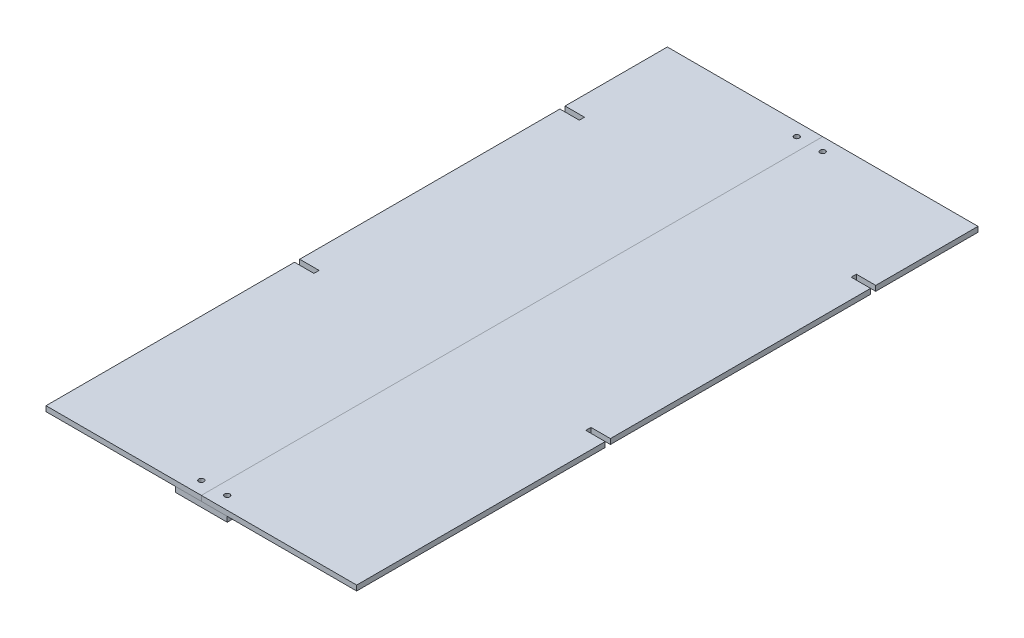
ISO-10303-21;
HEADER;
FILE_DESCRIPTION(('STEP AP214'),'2;1');
FILE_NAME('part.step','',(''),(''),'','','');
FILE_SCHEMA(('AUTOMOTIVE_DESIGN { 1 0 10303 214 1 1 1 1 }'));
ENDSEC;
DATA;
#1=APPLICATION_CONTEXT('core data for automotive mechanical design processes');
#2=APPLICATION_PROTOCOL_DEFINITION('international standard','automotive_design',2000,#1);
#3=PRODUCT_CONTEXT('',#1,'mechanical');
#4=PRODUCT('Part','Part','',(#3));
#5=PRODUCT_RELATED_PRODUCT_CATEGORY('part','',(#4));
#6=PRODUCT_DEFINITION_FORMATION('','',#4);
#7=PRODUCT_DEFINITION_CONTEXT('part definition',#1,'design');
#8=PRODUCT_DEFINITION('design','',#6,#7);
#9=PRODUCT_DEFINITION_SHAPE('','',#8);
#10=(LENGTH_UNIT() NAMED_UNIT(*) SI_UNIT(.MILLI.,.METRE.));
#11=(NAMED_UNIT(*) PLANE_ANGLE_UNIT() SI_UNIT($,.RADIAN.));
#12=(NAMED_UNIT(*) SI_UNIT($,.STERADIAN.) SOLID_ANGLE_UNIT());
#13=UNCERTAINTY_MEASURE_WITH_UNIT(LENGTH_MEASURE(1.E-05),#10,'distance_accuracy_value','');
#14=(GEOMETRIC_REPRESENTATION_CONTEXT(3) GLOBAL_UNCERTAINTY_ASSIGNED_CONTEXT((#13)) GLOBAL_UNIT_ASSIGNED_CONTEXT((#10,
#11,#12)) REPRESENTATION_CONTEXT('',''));
#15=CARTESIAN_POINT('',(0.,0.,0.));
#16=DIRECTION('',(0.,0.,1.));
#17=DIRECTION('',(1.,0.,0.));
#18=AXIS2_PLACEMENT_3D('',#15,#16,#17);
#19=CARTESIAN_POINT('',(-25.4,-5.08,304.8));
#20=DIRECTION('',(1.,0.,0.));
#21=DIRECTION('',(0.,0.,-1.));
#22=AXIS2_PLACEMENT_3D('',#19,#20,#21);
#23=PLANE('',#22);
#24=DIRECTION('',(0.,0.,-1.));
#25=VECTOR('',#24,1.);
#26=CARTESIAN_POINT('',(-25.4,0.,304.8));
#27=LINE('',#26,#25);
#28=CARTESIAN_POINT('',(-25.4,0.,304.8));
#29=VERTEX_POINT('',#28);
#30=CARTESIAN_POINT('',(-25.4,0.,-304.8));
#31=VERTEX_POINT('',#30);
#32=EDGE_CURVE('E134',#29,#31,#27,.T.);
#33=ORIENTED_EDGE('',*,*,#32,.T.);
#34=DIRECTION('',(0.,1.,0.));
#35=VECTOR('',#34,1.);
#36=CARTESIAN_POINT('',(-25.4,-5.08,-304.8));
#37=LINE('',#36,#35);
#38=CARTESIAN_POINT('',(-25.4,-5.08,-304.8));
#39=VERTEX_POINT('',#38);
#40=EDGE_CURVE('E13',#39,#31,#37,.T.);
#41=ORIENTED_EDGE('',*,*,#40,.F.);
#42=DIRECTION('',(0.,0.,-1.));
#43=VECTOR('',#42,1.);
#44=CARTESIAN_POINT('',(-25.4,-5.08,304.8));
#45=LINE('',#44,#43);
#46=CARTESIAN_POINT('',(-25.4,-5.08,304.8));
#47=VERTEX_POINT('',#46);
#48=EDGE_CURVE('E105',#47,#39,#45,.T.);
#49=ORIENTED_EDGE('',*,*,#48,.F.);
#50=DIRECTION('',(0.,1.,0.));
#51=VECTOR('',#50,1.);
#52=CARTESIAN_POINT('',(-25.4,-5.08,304.8));
#53=LINE('',#52,#51);
#54=EDGE_CURVE('E116',#47,#29,#53,.T.);
#55=ORIENTED_EDGE('',*,*,#54,.T.);
#56=EDGE_LOOP('',(#33,#41,#49,#55));
#57=FACE_BOUND('',#56,.T.);
#58=ADVANCED_FACE('F54',(#57),#23,.F.);
#59=CARTESIAN_POINT('',(25.4,-5.08,-304.8));
#60=DIRECTION('',(0.,0.,1.));
#61=DIRECTION('',(1.,0.,0.));
#62=AXIS2_PLACEMENT_3D('',#59,#60,#61);
#63=PLANE('',#62);
#64=DIRECTION('',(1.,0.,0.));
#65=VECTOR('',#64,1.);
#66=CARTESIAN_POINT('',(25.4,0.,-304.8));
#67=LINE('',#66,#65);
#68=CARTESIAN_POINT('',(25.4,0.,-304.8));
#69=VERTEX_POINT('',#68);
#70=EDGE_CURVE('E110',#31,#69,#67,.T.);
#71=ORIENTED_EDGE('',*,*,#70,.T.);
#72=DIRECTION('',(0.,1.,0.));
#73=VECTOR('',#72,1.);
#74=CARTESIAN_POINT('',(25.4,-5.08,-304.8));
#75=LINE('',#74,#73);
#76=CARTESIAN_POINT('',(25.4,-5.08,-304.8));
#77=VERTEX_POINT('',#76);
#78=EDGE_CURVE('E62',#77,#69,#75,.T.);
#79=ORIENTED_EDGE('',*,*,#78,.F.);
#80=DIRECTION('',(1.,0.,0.));
#81=VECTOR('',#80,1.);
#82=CARTESIAN_POINT('',(25.4,-5.08,-304.8));
#83=LINE('',#82,#81);
#84=EDGE_CURVE('E100',#39,#77,#83,.T.);
#85=ORIENTED_EDGE('',*,*,#84,.F.);
#86=ORIENTED_EDGE('',*,*,#40,.T.);
#87=EDGE_LOOP('',(#71,#79,#85,#86));
#88=FACE_BOUND('',#87,.T.);
#89=ADVANCED_FACE('F109',(#88),#63,.F.);
#90=CARTESIAN_POINT('',(25.4,-5.08,304.8));
#91=DIRECTION('',(-1.,0.,0.));
#92=DIRECTION('',(0.,0.,1.));
#93=AXIS2_PLACEMENT_3D('',#90,#91,#92);
#94=PLANE('',#93);
#95=DIRECTION('',(0.,0.,1.));
#96=VECTOR('',#95,1.);
#97=CARTESIAN_POINT('',(25.4,0.,304.8));
#98=LINE('',#97,#96);
#99=CARTESIAN_POINT('',(25.4,0.,304.8));
#100=VERTEX_POINT('',#99);
#101=EDGE_CURVE('E87',#69,#100,#98,.T.);
#102=ORIENTED_EDGE('',*,*,#101,.T.);
#103=DIRECTION('',(0.,1.,0.));
#104=VECTOR('',#103,1.);
#105=CARTESIAN_POINT('',(25.4,-5.08,304.8));
#106=LINE('',#105,#104);
#107=CARTESIAN_POINT('',(25.4,-5.08,304.8));
#108=VERTEX_POINT('',#107);
#109=EDGE_CURVE('E111',#108,#100,#106,.T.);
#110=ORIENTED_EDGE('',*,*,#109,.F.);
#111=DIRECTION('',(0.,0.,1.));
#112=VECTOR('',#111,1.);
#113=CARTESIAN_POINT('',(25.4,-5.08,304.8));
#114=LINE('',#113,#112);
#115=EDGE_CURVE('E103',#77,#108,#114,.T.);
#116=ORIENTED_EDGE('',*,*,#115,.F.);
#117=ORIENTED_EDGE('',*,*,#78,.T.);
#118=EDGE_LOOP('',(#102,#110,#116,#117));
#119=FACE_BOUND('',#118,.T.);
#120=ADVANCED_FACE('F112',(#119),#94,.F.);
#121=CARTESIAN_POINT('',(25.4,-5.08,304.8));
#122=DIRECTION('',(0.,0.,-1.));
#123=DIRECTION('',(-1.,0.,0.));
#124=AXIS2_PLACEMENT_3D('',#121,#122,#123);
#125=PLANE('',#124);
#126=DIRECTION('',(-1.,0.,0.));
#127=VECTOR('',#126,1.);
#128=CARTESIAN_POINT('',(25.4,0.,304.8));
#129=LINE('',#128,#127);
#130=EDGE_CURVE('E93',#100,#29,#129,.T.);
#131=ORIENTED_EDGE('',*,*,#130,.T.);
#132=ORIENTED_EDGE('',*,*,#54,.F.);
#133=DIRECTION('',(-1.,0.,0.));
#134=VECTOR('',#133,1.);
#135=CARTESIAN_POINT('',(25.4,-5.08,304.8));
#136=LINE('',#135,#134);
#137=EDGE_CURVE('E70',#108,#47,#136,.T.);
#138=ORIENTED_EDGE('',*,*,#137,.F.);
#139=ORIENTED_EDGE('',*,*,#109,.T.);
#140=EDGE_LOOP('',(#131,#132,#138,#139));
#141=FACE_BOUND('',#140,.T.);
#142=ADVANCED_FACE('F186',(#141),#125,.F.);
#143=CARTESIAN_POINT('',(0.,-5.08,0.));
#144=DIRECTION('',(0.,1.,0.));
#145=DIRECTION('',(0.,0.,1.));
#146=AXIS2_PLACEMENT_3D('',#143,#144,#145);
#147=PLANE('',#146);
#148=CARTESIAN_POINT('',(-12.7,-5.08,292.1));
#149=DIRECTION('',(0.,1.,0.));
#150=DIRECTION('',(0.,0.,1.));
#151=AXIS2_PLACEMENT_3D('',#148,#149,#150);
#152=CIRCLE('',#151,2.0193);
#153=CARTESIAN_POINT('',(-12.7,-5.08,294.1193));
#154=VERTEX_POINT('',#153);
#155=EDGE_CURVE('E155',#154,#154,#152,.T.);
#156=ORIENTED_EDGE('',*,*,#155,.T.);
#157=EDGE_LOOP('',(#156));
#158=FACE_BOUND('',#157,.T.);
#159=CARTESIAN_POINT('',(12.7,-5.08,292.1));
#160=DIRECTION('',(0.,1.,0.));
#161=DIRECTION('',(0.,0.,1.));
#162=AXIS2_PLACEMENT_3D('',#159,#160,#161);
#163=CIRCLE('',#162,2.0193);
#164=CARTESIAN_POINT('',(12.7,-5.08,294.1193));
#165=VERTEX_POINT('',#164);
#166=EDGE_CURVE('E148',#165,#165,#163,.T.);
#167=ORIENTED_EDGE('',*,*,#166,.T.);
#168=EDGE_LOOP('',(#167));
#169=FACE_BOUND('',#168,.T.);
#170=CARTESIAN_POINT('',(-12.7,-5.08,-292.1));
#171=DIRECTION('',(0.,1.,0.));
#172=DIRECTION('',(0.,0.,1.));
#173=AXIS2_PLACEMENT_3D('',#170,#171,#172);
#174=CIRCLE('',#173,2.0193);
#175=CARTESIAN_POINT('',(-12.7,-5.08,-290.0807));
#176=VERTEX_POINT('',#175);
#177=EDGE_CURVE('E138',#176,#176,#174,.T.);
#178=ORIENTED_EDGE('',*,*,#177,.T.);
#179=EDGE_LOOP('',(#178));
#180=FACE_BOUND('',#179,.T.);
#181=CARTESIAN_POINT('',(12.7,-5.08,-292.1));
#182=DIRECTION('',(0.,1.,0.));
#183=DIRECTION('',(0.,0.,1.));
#184=AXIS2_PLACEMENT_3D('',#181,#182,#183);
#185=CIRCLE('',#184,2.0193);
#186=CARTESIAN_POINT('',(12.7,-5.08,-290.0807));
#187=VERTEX_POINT('',#186);
#188=EDGE_CURVE('E129',#187,#187,#185,.T.);
#189=ORIENTED_EDGE('',*,*,#188,.T.);
#190=EDGE_LOOP('',(#189));
#191=FACE_BOUND('',#190,.T.);
#192=ORIENTED_EDGE('',*,*,#48,.T.);
#193=ORIENTED_EDGE('',*,*,#84,.T.);
#194=ORIENTED_EDGE('',*,*,#115,.T.);
#195=ORIENTED_EDGE('',*,*,#137,.T.);
#196=EDGE_LOOP('',(#192,#193,#194,#195));
#197=FACE_BOUND('',#196,.T.);
#198=ADVANCED_FACE('F101',(#158,#169,#180,#191,#197),#147,.F.);
#199=CARTESIAN_POINT('',(0.,0.,0.));
#200=DIRECTION('',(0.,1.,0.));
#201=DIRECTION('',(0.,0.,1.));
#202=AXIS2_PLACEMENT_3D('',#199,#200,#201);
#203=PLANE('',#202);
#204=CARTESIAN_POINT('',(-12.7,0.,292.1));
#205=DIRECTION('',(0.,1.,0.));
#206=DIRECTION('',(0.,0.,1.));
#207=AXIS2_PLACEMENT_3D('',#204,#205,#206);
#208=CIRCLE('',#207,2.0193);
#209=CARTESIAN_POINT('',(-12.7,0.,294.1193));
#210=VERTEX_POINT('',#209);
#211=EDGE_CURVE('E160',#210,#210,#208,.T.);
#212=ORIENTED_EDGE('',*,*,#211,.F.);
#213=EDGE_LOOP('',(#212));
#214=FACE_BOUND('',#213,.T.);
#215=CARTESIAN_POINT('',(12.7,0.,292.1));
#216=DIRECTION('',(0.,1.,0.));
#217=DIRECTION('',(0.,0.,1.));
#218=AXIS2_PLACEMENT_3D('',#215,#216,#217);
#219=CIRCLE('',#218,2.0193);
#220=CARTESIAN_POINT('',(12.7,0.,294.1193));
#221=VERTEX_POINT('',#220);
#222=EDGE_CURVE('E153',#221,#221,#219,.T.);
#223=ORIENTED_EDGE('',*,*,#222,.F.);
#224=EDGE_LOOP('',(#223));
#225=FACE_BOUND('',#224,.T.);
#226=CARTESIAN_POINT('',(-12.7,0.,-292.1));
#227=DIRECTION('',(0.,1.,0.));
#228=DIRECTION('',(0.,0.,1.));
#229=AXIS2_PLACEMENT_3D('',#226,#227,#228);
#230=CIRCLE('',#229,2.0193);
#231=CARTESIAN_POINT('',(-12.7,0.,-290.0807));
#232=VERTEX_POINT('',#231);
#233=EDGE_CURVE('E143',#232,#232,#230,.T.);
#234=ORIENTED_EDGE('',*,*,#233,.F.);
#235=EDGE_LOOP('',(#234));
#236=FACE_BOUND('',#235,.T.);
#237=CARTESIAN_POINT('',(12.7,0.,-292.1));
#238=DIRECTION('',(0.,1.,0.));
#239=DIRECTION('',(0.,0.,1.));
#240=AXIS2_PLACEMENT_3D('',#237,#238,#239);
#241=CIRCLE('',#240,2.0193);
#242=CARTESIAN_POINT('',(12.7,0.,-290.0807));
#243=VERTEX_POINT('',#242);
#244=EDGE_CURVE('E135',#243,#243,#241,.T.);
#245=ORIENTED_EDGE('',*,*,#244,.F.);
#246=EDGE_LOOP('',(#245));
#247=FACE_BOUND('',#246,.T.);
#248=ORIENTED_EDGE('',*,*,#32,.F.);
#249=ORIENTED_EDGE('',*,*,#130,.F.);
#250=ORIENTED_EDGE('',*,*,#101,.F.);
#251=ORIENTED_EDGE('',*,*,#70,.F.);
#252=EDGE_LOOP('',(#248,#249,#250,#251));
#253=FACE_BOUND('',#252,.T.);
#254=ADVANCED_FACE('F166',(#214,#225,#236,#247,#253),#203,.T.);
#255=CARTESIAN_POINT('',(12.7,0.,-292.1));
#256=DIRECTION('',(0.,1.,0.));
#257=DIRECTION('',(0.,0.,1.));
#258=AXIS2_PLACEMENT_3D('',#255,#256,#257);
#259=CYLINDRICAL_SURFACE('',#258,2.0193);
#260=ORIENTED_EDGE('',*,*,#188,.F.);
#261=EDGE_LOOP('',(#260));
#262=FACE_BOUND('',#261,.T.);
#263=ORIENTED_EDGE('',*,*,#244,.T.);
#264=EDGE_LOOP('',(#263));
#265=FACE_BOUND('',#264,.T.);
#266=ADVANCED_FACE('F169',(#262,#265),#259,.F.);
#267=CARTESIAN_POINT('',(-12.7,0.,-292.1));
#268=DIRECTION('',(0.,1.,0.));
#269=DIRECTION('',(0.,0.,1.));
#270=AXIS2_PLACEMENT_3D('',#267,#268,#269);
#271=CYLINDRICAL_SURFACE('',#270,2.0193);
#272=ORIENTED_EDGE('',*,*,#177,.F.);
#273=EDGE_LOOP('',(#272));
#274=FACE_BOUND('',#273,.T.);
#275=ORIENTED_EDGE('',*,*,#233,.T.);
#276=EDGE_LOOP('',(#275));
#277=FACE_BOUND('',#276,.T.);
#278=ADVANCED_FACE('F203',(#274,#277),#271,.F.);
#279=CARTESIAN_POINT('',(12.7,0.,292.1));
#280=DIRECTION('',(0.,1.,0.));
#281=DIRECTION('',(0.,0.,1.));
#282=AXIS2_PLACEMENT_3D('',#279,#280,#281);
#283=CYLINDRICAL_SURFACE('',#282,2.0193);
#284=ORIENTED_EDGE('',*,*,#166,.F.);
#285=EDGE_LOOP('',(#284));
#286=FACE_BOUND('',#285,.T.);
#287=ORIENTED_EDGE('',*,*,#222,.T.);
#288=EDGE_LOOP('',(#287));
#289=FACE_BOUND('',#288,.T.);
#290=ADVANCED_FACE('F207',(#286,#289),#283,.F.);
#291=CARTESIAN_POINT('',(-12.7,0.,292.1));
#292=DIRECTION('',(0.,1.,0.));
#293=DIRECTION('',(0.,0.,1.));
#294=AXIS2_PLACEMENT_3D('',#291,#292,#293);
#295=CYLINDRICAL_SURFACE('',#294,2.0193);
#296=ORIENTED_EDGE('',*,*,#155,.F.);
#297=EDGE_LOOP('',(#296));
#298=FACE_BOUND('',#297,.T.);
#299=ORIENTED_EDGE('',*,*,#211,.T.);
#300=EDGE_LOOP('',(#299));
#301=FACE_BOUND('',#300,.T.);
#302=ADVANCED_FACE('F164',(#298,#301),#295,.F.);
#303=CLOSED_SHELL('',(#58,#89,#120,#142,#198,#254,#266,#278,#290,#302));
#304=MANIFOLD_SOLID_BREP('B2',#303);
#305=CARTESIAN_POINT('',(0.,0.,0.));
#306=DIRECTION('',(1.,0.,0.));
#307=DIRECTION('',(0.,0.,-1.));
#308=AXIS2_PLACEMENT_3D('',#305,#306,#307);
#309=PLANE('',#308);
#310=DIRECTION('',(0.,0.,-1.));
#311=VECTOR('',#310,1.);
#312=CARTESIAN_POINT('',(0.,5.08,0.));
#313=LINE('',#312,#311);
#314=CARTESIAN_POINT('',(0.,5.08,304.8));
#315=VERTEX_POINT('',#314);
#316=CARTESIAN_POINT('',(0.,5.08,-304.8));
#317=VERTEX_POINT('',#316);
#318=EDGE_CURVE('E469',#315,#317,#313,.T.);
#319=ORIENTED_EDGE('',*,*,#318,.F.);
#320=DIRECTION('',(0.,-1.,0.));
#321=VECTOR('',#320,1.);
#322=CARTESIAN_POINT('',(0.,5.08,304.8));
#323=LINE('',#322,#321);
#324=CARTESIAN_POINT('',(0.,0.,304.8));
#325=VERTEX_POINT('',#324);
#326=EDGE_CURVE('E488',#315,#325,#323,.T.);
#327=ORIENTED_EDGE('',*,*,#326,.T.);
#328=DIRECTION('',(0.,0.,-1.));
#329=VECTOR('',#328,1.);
#330=CARTESIAN_POINT('',(0.,0.,0.));
#331=LINE('',#330,#329);
#332=CARTESIAN_POINT('',(0.,0.,-304.8));
#333=VERTEX_POINT('',#332);
#334=EDGE_CURVE('E453',#325,#333,#331,.T.);
#335=ORIENTED_EDGE('',*,*,#334,.T.);
#336=DIRECTION('',(0.,1.,0.));
#337=VECTOR('',#336,1.);
#338=CARTESIAN_POINT('',(0.,5.08,-304.8));
#339=LINE('',#338,#337);
#340=EDGE_CURVE('E489',#333,#317,#339,.T.);
#341=ORIENTED_EDGE('',*,*,#340,.T.);
#342=EDGE_LOOP('',(#319,#327,#335,#341));
#343=FACE_BOUND('',#342,.T.);
#344=ADVANCED_FACE('F302',(#343),#309,.T.);
#345=CARTESIAN_POINT('',(152.4,5.08,-304.8));
#346=DIRECTION('',(0.,0.,1.));
#347=DIRECTION('',(1.,0.,0.));
#348=AXIS2_PLACEMENT_3D('',#345,#346,#347);
#349=PLANE('',#348);
#350=ORIENTED_EDGE('',*,*,#340,.F.);
#351=DIRECTION('',(-1.,0.,0.));
#352=VECTOR('',#351,1.);
#353=CARTESIAN_POINT('',(152.4,0.,-304.8));
#354=LINE('',#353,#352);
#355=CARTESIAN_POINT('',(-152.4,0.,-304.8));
#356=VERTEX_POINT('',#355);
#357=EDGE_CURVE('E306',#333,#356,#354,.T.);
#358=ORIENTED_EDGE('',*,*,#357,.T.);
#359=DIRECTION('',(0.,-1.,0.));
#360=VECTOR('',#359,1.);
#361=CARTESIAN_POINT('',(-152.4,5.08,-304.8));
#362=LINE('',#361,#360);
#363=CARTESIAN_POINT('',(-152.4,5.08,-304.8));
#364=VERTEX_POINT('',#363);
#365=EDGE_CURVE('E389',#364,#356,#362,.T.);
#366=ORIENTED_EDGE('',*,*,#365,.F.);
#367=DIRECTION('',(-1.,0.,0.));
#368=VECTOR('',#367,1.);
#369=CARTESIAN_POINT('',(152.4,5.08,-304.8));
#370=LINE('',#369,#368);
#371=EDGE_CURVE('E396',#317,#364,#370,.T.);
#372=ORIENTED_EDGE('',*,*,#371,.F.);
#373=EDGE_LOOP('',(#350,#358,#366,#372));
#374=FACE_BOUND('',#373,.T.);
#375=ADVANCED_FACE('F572',(#374),#349,.F.);
#376=CARTESIAN_POINT('',(152.4,5.08,304.8));
#377=DIRECTION('',(0.,0.,-1.));
#378=DIRECTION('',(-1.,0.,0.));
#379=AXIS2_PLACEMENT_3D('',#376,#377,#378);
#380=PLANE('',#379);
#381=ORIENTED_EDGE('',*,*,#326,.F.);
#382=DIRECTION('',(1.,0.,0.));
#383=VECTOR('',#382,1.);
#384=CARTESIAN_POINT('',(152.4,5.08,304.8));
#385=LINE('',#384,#383);
#386=CARTESIAN_POINT('',(-152.4,5.08,304.8));
#387=VERTEX_POINT('',#386);
#388=EDGE_CURVE('E434',#387,#315,#385,.T.);
#389=ORIENTED_EDGE('',*,*,#388,.F.);
#390=DIRECTION('',(0.,-1.,0.));
#391=VECTOR('',#390,1.);
#392=CARTESIAN_POINT('',(-152.4,5.08,304.8));
#393=LINE('',#392,#391);
#394=CARTESIAN_POINT('',(-152.4,0.,304.8));
#395=VERTEX_POINT('',#394);
#396=EDGE_CURVE('E452',#387,#395,#393,.T.);
#397=ORIENTED_EDGE('',*,*,#396,.T.);
#398=DIRECTION('',(1.,0.,0.));
#399=VECTOR('',#398,1.);
#400=CARTESIAN_POINT('',(152.4,0.,304.8));
#401=LINE('',#400,#399);
#402=EDGE_CURVE('E391',#395,#325,#401,.T.);
#403=ORIENTED_EDGE('',*,*,#402,.T.);
#404=EDGE_LOOP('',(#381,#389,#397,#403));
#405=FACE_BOUND('',#404,.T.);
#406=ADVANCED_FACE('F474',(#405),#380,.F.);
#407=CARTESIAN_POINT('',(0.,5.08,0.));
#408=DIRECTION('',(0.,1.,0.));
#409=DIRECTION('',(0.,0.,1.));
#410=AXIS2_PLACEMENT_3D('',#407,#408,#409);
#411=PLANE('',#410);
#412=CARTESIAN_POINT('',(-12.7,5.08,-292.1));
#413=DIRECTION('',(0.,1.,0.));
#414=DIRECTION('',(0.,0.,1.));
#415=AXIS2_PLACEMENT_3D('',#412,#413,#414);
#416=CIRCLE('',#415,2.55269999999999);
#417=CARTESIAN_POINT('',(-12.7,5.08,-289.5473));
#418=VERTEX_POINT('',#417);
#419=EDGE_CURVE('E597',#418,#418,#416,.T.);
#420=ORIENTED_EDGE('',*,*,#419,.F.);
#421=EDGE_LOOP('',(#420));
#422=FACE_BOUND('',#421,.T.);
#423=CARTESIAN_POINT('',(-12.7,5.08,292.1));
#424=DIRECTION('',(0.,1.,0.));
#425=DIRECTION('',(0.,0.,1.));
#426=AXIS2_PLACEMENT_3D('',#423,#424,#425);
#427=CIRCLE('',#426,2.55269999999999);
#428=CARTESIAN_POINT('',(-12.7,5.08,294.6527));
#429=VERTEX_POINT('',#428);
#430=EDGE_CURVE('E459',#429,#429,#427,.T.);
#431=ORIENTED_EDGE('',*,*,#430,.F.);
#432=EDGE_LOOP('',(#431));
#433=FACE_BOUND('',#432,.T.);
#434=ORIENTED_EDGE('',*,*,#388,.T.);
#435=ORIENTED_EDGE('',*,*,#318,.T.);
#436=ORIENTED_EDGE('',*,*,#371,.T.);
#437=DIRECTION('',(0.,0.,1.));
#438=VECTOR('',#437,1.);
#439=CARTESIAN_POINT('',(-152.4,5.08,304.8));
#440=LINE('',#439,#438);
#441=CARTESIAN_POINT('',(-152.4,5.08,-204.47));
#442=VERTEX_POINT('',#441);
#443=EDGE_CURVE('E429',#364,#442,#440,.T.);
#444=ORIENTED_EDGE('',*,*,#443,.T.);
#445=DIRECTION('',(-1.,0.,0.));
#446=VECTOR('',#445,1.);
#447=CARTESIAN_POINT('',(-152.4,5.08,-204.47));
#448=LINE('',#447,#446);
#449=CARTESIAN_POINT('',(-133.35,5.08,-204.47));
#450=VERTEX_POINT('',#449);
#451=EDGE_CURVE('E369',#450,#442,#448,.T.);
#452=ORIENTED_EDGE('',*,*,#451,.F.);
#453=DIRECTION('',(0.,0.,-1.));
#454=VECTOR('',#453,1.);
#455=CARTESIAN_POINT('',(-133.35,5.08,-204.47));
#456=LINE('',#455,#454);
#457=CARTESIAN_POINT('',(-133.35,5.08,-199.39));
#458=VERTEX_POINT('',#457);
#459=EDGE_CURVE('E384',#458,#450,#456,.T.);
#460=ORIENTED_EDGE('',*,*,#459,.F.);
#461=DIRECTION('',(1.,0.,0.));
#462=VECTOR('',#461,1.);
#463=CARTESIAN_POINT('',(-152.4,5.08,-199.39));
#464=LINE('',#463,#462);
#465=CARTESIAN_POINT('',(-152.4,5.08,-199.39));
#466=VERTEX_POINT('',#465);
#467=EDGE_CURVE('E418',#466,#458,#464,.T.);
#468=ORIENTED_EDGE('',*,*,#467,.F.);
#469=CARTESIAN_POINT('',(-152.4,5.08,55.88));
#470=VERTEX_POINT('',#469);
#471=EDGE_CURVE('E433',#466,#470,#440,.T.);
#472=ORIENTED_EDGE('',*,*,#471,.T.);
#473=DIRECTION('',(-1.,0.,0.));
#474=VECTOR('',#473,1.);
#475=CARTESIAN_POINT('',(-152.4,5.08,55.88));
#476=LINE('',#475,#474);
#477=CARTESIAN_POINT('',(-133.35,5.08,55.88));
#478=VERTEX_POINT('',#477);
#479=EDGE_CURVE('E529',#478,#470,#476,.T.);
#480=ORIENTED_EDGE('',*,*,#479,.F.);
#481=DIRECTION('',(0.,0.,-1.));
#482=VECTOR('',#481,1.);
#483=CARTESIAN_POINT('',(-133.35,5.08,60.96));
#484=LINE('',#483,#482);
#485=CARTESIAN_POINT('',(-133.35,5.08,60.96));
#486=VERTEX_POINT('',#485);
#487=EDGE_CURVE('E313',#486,#478,#484,.T.);
#488=ORIENTED_EDGE('',*,*,#487,.F.);
#489=DIRECTION('',(1.,0.,0.));
#490=VECTOR('',#489,1.);
#491=CARTESIAN_POINT('',(-152.4,5.08,60.96));
#492=LINE('',#491,#490);
#493=CARTESIAN_POINT('',(-152.4,5.08,60.96));
#494=VERTEX_POINT('',#493);
#495=EDGE_CURVE('E52',#494,#486,#492,.T.);
#496=ORIENTED_EDGE('',*,*,#495,.F.);
#497=EDGE_CURVE('E435',#494,#387,#440,.T.);
#498=ORIENTED_EDGE('',*,*,#497,.T.);
#499=EDGE_LOOP('',(#434,#435,#436,#444,#452,#460,#468,#472,#480,#488,#496,#498));
#500=FACE_BOUND('',#499,.T.);
#501=ADVANCED_FACE('F304',(#422,#433,#500),#411,.T.);
#502=CARTESIAN_POINT('',(0.,0.,0.));
#503=DIRECTION('',(0.,1.,0.));
#504=DIRECTION('',(0.,0.,1.));
#505=AXIS2_PLACEMENT_3D('',#502,#503,#504);
#506=PLANE('',#505);
#507=CARTESIAN_POINT('',(-12.7,0.,-292.1));
#508=DIRECTION('',(0.,1.,0.));
#509=DIRECTION('',(0.,0.,1.));
#510=AXIS2_PLACEMENT_3D('',#507,#508,#509);
#511=CIRCLE('',#510,2.5527);
#512=CARTESIAN_POINT('',(-12.7,0.,-289.5473));
#513=VERTEX_POINT('',#512);
#514=EDGE_CURVE('E466',#513,#513,#511,.T.);
#515=ORIENTED_EDGE('',*,*,#514,.T.);
#516=EDGE_LOOP('',(#515));
#517=FACE_BOUND('',#516,.T.);
#518=CARTESIAN_POINT('',(-12.7,0.,292.1));
#519=DIRECTION('',(0.,1.,0.));
#520=DIRECTION('',(0.,0.,1.));
#521=AXIS2_PLACEMENT_3D('',#518,#519,#520);
#522=CIRCLE('',#521,2.5527);
#523=CARTESIAN_POINT('',(-12.7,0.,294.6527));
#524=VERTEX_POINT('',#523);
#525=EDGE_CURVE('E465',#524,#524,#522,.T.);
#526=ORIENTED_EDGE('',*,*,#525,.T.);
#527=EDGE_LOOP('',(#526));
#528=FACE_BOUND('',#527,.T.);
#529=ORIENTED_EDGE('',*,*,#334,.F.);
#530=ORIENTED_EDGE('',*,*,#402,.F.);
#531=DIRECTION('',(0.,0.,1.));
#532=VECTOR('',#531,1.);
#533=CARTESIAN_POINT('',(-152.4,0.,304.8));
#534=LINE('',#533,#532);
#535=CARTESIAN_POINT('',(-152.4,0.,60.96));
#536=VERTEX_POINT('',#535);
#537=EDGE_CURVE('E393',#536,#395,#534,.T.);
#538=ORIENTED_EDGE('',*,*,#537,.F.);
#539=DIRECTION('',(1.,0.,0.));
#540=VECTOR('',#539,1.);
#541=CARTESIAN_POINT('',(-152.4,0.,60.96));
#542=LINE('',#541,#540);
#543=CARTESIAN_POINT('',(-133.35,0.,60.96));
#544=VERTEX_POINT('',#543);
#545=EDGE_CURVE('E537',#536,#544,#542,.T.);
#546=ORIENTED_EDGE('',*,*,#545,.T.);
#547=DIRECTION('',(0.,0.,-1.));
#548=VECTOR('',#547,1.);
#549=CARTESIAN_POINT('',(-133.35,0.,60.96));
#550=LINE('',#549,#548);
#551=CARTESIAN_POINT('',(-133.35,0.,55.88));
#552=VERTEX_POINT('',#551);
#553=EDGE_CURVE('E548',#544,#552,#550,.T.);
#554=ORIENTED_EDGE('',*,*,#553,.T.);
#555=DIRECTION('',(-1.,0.,0.));
#556=VECTOR('',#555,1.);
#557=CARTESIAN_POINT('',(-152.4,0.,55.88));
#558=LINE('',#557,#556);
#559=CARTESIAN_POINT('',(-152.4,0.,55.88));
#560=VERTEX_POINT('',#559);
#561=EDGE_CURVE('E550',#552,#560,#558,.T.);
#562=ORIENTED_EDGE('',*,*,#561,.T.);
#563=CARTESIAN_POINT('',(-152.4,0.,-199.39));
#564=VERTEX_POINT('',#563);
#565=EDGE_CURVE('E390',#564,#560,#534,.T.);
#566=ORIENTED_EDGE('',*,*,#565,.F.);
#567=DIRECTION('',(1.,0.,0.));
#568=VECTOR('',#567,1.);
#569=CARTESIAN_POINT('',(-152.4,0.,-199.39));
#570=LINE('',#569,#568);
#571=CARTESIAN_POINT('',(-133.35,0.,-199.39));
#572=VERTEX_POINT('',#571);
#573=EDGE_CURVE('E357',#564,#572,#570,.T.);
#574=ORIENTED_EDGE('',*,*,#573,.T.);
#575=DIRECTION('',(0.,0.,-1.));
#576=VECTOR('',#575,1.);
#577=CARTESIAN_POINT('',(-133.35,0.,-204.47));
#578=LINE('',#577,#576);
#579=CARTESIAN_POINT('',(-133.35,0.,-204.47));
#580=VERTEX_POINT('',#579);
#581=EDGE_CURVE('E374',#572,#580,#578,.T.);
#582=ORIENTED_EDGE('',*,*,#581,.T.);
#583=DIRECTION('',(-1.,0.,0.));
#584=VECTOR('',#583,1.);
#585=CARTESIAN_POINT('',(-152.4,0.,-204.47));
#586=LINE('',#585,#584);
#587=CARTESIAN_POINT('',(-152.4,0.,-204.47));
#588=VERTEX_POINT('',#587);
#589=EDGE_CURVE('E366',#580,#588,#586,.T.);
#590=ORIENTED_EDGE('',*,*,#589,.T.);
#591=EDGE_CURVE('E382',#356,#588,#534,.T.);
#592=ORIENTED_EDGE('',*,*,#591,.F.);
#593=ORIENTED_EDGE('',*,*,#357,.F.);
#594=EDGE_LOOP('',(#529,#530,#538,#546,#554,#562,#566,#574,#582,#590,#592,#593));
#595=FACE_BOUND('',#594,.T.);
#596=ADVANCED_FACE('F380',(#517,#528,#595),#506,.F.);
#597=CARTESIAN_POINT('',(-152.4,5.08,304.8));
#598=DIRECTION('',(1.,0.,0.));
#599=DIRECTION('',(0.,0.,-1.));
#600=AXIS2_PLACEMENT_3D('',#597,#598,#599);
#601=PLANE('',#600);
#602=ORIENTED_EDGE('',*,*,#497,.F.);
#603=DIRECTION('',(0.,1.,0.));
#604=VECTOR('',#603,1.);
#605=CARTESIAN_POINT('',(-152.4,0.,60.96));
#606=LINE('',#605,#604);
#607=EDGE_CURVE('E499',#536,#494,#606,.T.);
#608=ORIENTED_EDGE('',*,*,#607,.F.);
#609=ORIENTED_EDGE('',*,*,#537,.T.);
#610=ORIENTED_EDGE('',*,*,#396,.F.);
#611=EDGE_LOOP('',(#602,#608,#609,#610));
#612=FACE_BOUND('',#611,.T.);
#613=ADVANCED_FACE('F544',(#612),#601,.F.);
#614=ORIENTED_EDGE('',*,*,#591,.T.);
#615=DIRECTION('',(0.,1.,0.));
#616=VECTOR('',#615,1.);
#617=CARTESIAN_POINT('',(-152.4,0.,-204.47));
#618=LINE('',#617,#616);
#619=EDGE_CURVE('E363',#588,#442,#618,.T.);
#620=ORIENTED_EDGE('',*,*,#619,.T.);
#621=ORIENTED_EDGE('',*,*,#443,.F.);
#622=ORIENTED_EDGE('',*,*,#365,.T.);
#623=EDGE_LOOP('',(#614,#620,#621,#622));
#624=FACE_BOUND('',#623,.T.);
#625=ADVANCED_FACE('F387',(#624),#601,.F.);
#626=ORIENTED_EDGE('',*,*,#565,.T.);
#627=DIRECTION('',(0.,1.,0.));
#628=VECTOR('',#627,1.);
#629=CARTESIAN_POINT('',(-152.4,0.,55.88));
#630=LINE('',#629,#628);
#631=EDGE_CURVE('E501',#560,#470,#630,.T.);
#632=ORIENTED_EDGE('',*,*,#631,.T.);
#633=ORIENTED_EDGE('',*,*,#471,.F.);
#634=DIRECTION('',(0.,1.,0.));
#635=VECTOR('',#634,1.);
#636=CARTESIAN_POINT('',(-152.4,0.,-199.39));
#637=LINE('',#636,#635);
#638=EDGE_CURVE('E375',#564,#466,#637,.T.);
#639=ORIENTED_EDGE('',*,*,#638,.F.);
#640=EDGE_LOOP('',(#626,#632,#633,#639));
#641=FACE_BOUND('',#640,.T.);
#642=ADVANCED_FACE('F539',(#641),#601,.F.);
#643=CARTESIAN_POINT('',(-152.4,0.,-204.47));
#644=DIRECTION('',(0.,0.,-1.));
#645=DIRECTION('',(-1.,0.,0.));
#646=AXIS2_PLACEMENT_3D('',#643,#644,#645);
#647=PLANE('',#646);
#648=ORIENTED_EDGE('',*,*,#451,.T.);
#649=ORIENTED_EDGE('',*,*,#619,.F.);
#650=ORIENTED_EDGE('',*,*,#589,.F.);
#651=DIRECTION('',(0.,1.,0.));
#652=VECTOR('',#651,1.);
#653=CARTESIAN_POINT('',(-133.35,0.,-204.47));
#654=LINE('',#653,#652);
#655=EDGE_CURVE('E406',#580,#450,#654,.T.);
#656=ORIENTED_EDGE('',*,*,#655,.T.);
#657=EDGE_LOOP('',(#648,#649,#650,#656));
#658=FACE_BOUND('',#657,.T.);
#659=ADVANCED_FACE('F365',(#658),#647,.F.);
#660=CARTESIAN_POINT('',(-133.35,0.,-204.47));
#661=DIRECTION('',(1.,0.,0.));
#662=DIRECTION('',(0.,0.,-1.));
#663=AXIS2_PLACEMENT_3D('',#660,#661,#662);
#664=PLANE('',#663);
#665=ORIENTED_EDGE('',*,*,#459,.T.);
#666=ORIENTED_EDGE('',*,*,#655,.F.);
#667=ORIENTED_EDGE('',*,*,#581,.F.);
#668=DIRECTION('',(0.,1.,0.));
#669=VECTOR('',#668,1.);
#670=CARTESIAN_POINT('',(-133.35,0.,-199.39));
#671=LINE('',#670,#669);
#672=EDGE_CURVE('E409',#572,#458,#671,.T.);
#673=ORIENTED_EDGE('',*,*,#672,.T.);
#674=EDGE_LOOP('',(#665,#666,#667,#673));
#675=FACE_BOUND('',#674,.T.);
#676=ADVANCED_FACE('F514',(#675),#664,.F.);
#677=CARTESIAN_POINT('',(-152.4,0.,-199.39));
#678=DIRECTION('',(0.,0.,1.));
#679=DIRECTION('',(1.,0.,0.));
#680=AXIS2_PLACEMENT_3D('',#677,#678,#679);
#681=PLANE('',#680);
#682=ORIENTED_EDGE('',*,*,#467,.T.);
#683=ORIENTED_EDGE('',*,*,#672,.F.);
#684=ORIENTED_EDGE('',*,*,#573,.F.);
#685=ORIENTED_EDGE('',*,*,#638,.T.);
#686=EDGE_LOOP('',(#682,#683,#684,#685));
#687=FACE_BOUND('',#686,.T.);
#688=ADVANCED_FACE('F508',(#687),#681,.F.);
#689=CARTESIAN_POINT('',(-152.4,0.,60.96));
#690=DIRECTION('',(0.,0.,1.));
#691=DIRECTION('',(1.,0.,0.));
#692=AXIS2_PLACEMENT_3D('',#689,#690,#691);
#693=PLANE('',#692);
#694=ORIENTED_EDGE('',*,*,#495,.T.);
#695=DIRECTION('',(0.,1.,0.));
#696=VECTOR('',#695,1.);
#697=CARTESIAN_POINT('',(-133.35,0.,60.96));
#698=LINE('',#697,#696);
#699=EDGE_CURVE('E322',#544,#486,#698,.T.);
#700=ORIENTED_EDGE('',*,*,#699,.F.);
#701=ORIENTED_EDGE('',*,*,#545,.F.);
#702=ORIENTED_EDGE('',*,*,#607,.T.);
#703=EDGE_LOOP('',(#694,#700,#701,#702));
#704=FACE_BOUND('',#703,.T.);
#705=ADVANCED_FACE('F546',(#704),#693,.F.);
#706=CARTESIAN_POINT('',(-152.4,0.,55.88));
#707=DIRECTION('',(0.,0.,-1.));
#708=DIRECTION('',(-1.,0.,0.));
#709=AXIS2_PLACEMENT_3D('',#706,#707,#708);
#710=PLANE('',#709);
#711=ORIENTED_EDGE('',*,*,#479,.T.);
#712=ORIENTED_EDGE('',*,*,#631,.F.);
#713=ORIENTED_EDGE('',*,*,#561,.F.);
#714=DIRECTION('',(0.,1.,0.));
#715=VECTOR('',#714,1.);
#716=CARTESIAN_POINT('',(-133.35,0.,55.88));
#717=LINE('',#716,#715);
#718=EDGE_CURVE('E534',#552,#478,#717,.T.);
#719=ORIENTED_EDGE('',*,*,#718,.T.);
#720=EDGE_LOOP('',(#711,#712,#713,#719));
#721=FACE_BOUND('',#720,.T.);
#722=ADVANCED_FACE('F531',(#721),#710,.F.);
#723=CARTESIAN_POINT('',(-133.35,0.,60.96));
#724=DIRECTION('',(1.,0.,0.));
#725=DIRECTION('',(0.,0.,-1.));
#726=AXIS2_PLACEMENT_3D('',#723,#724,#725);
#727=PLANE('',#726);
#728=ORIENTED_EDGE('',*,*,#487,.T.);
#729=ORIENTED_EDGE('',*,*,#718,.F.);
#730=ORIENTED_EDGE('',*,*,#553,.F.);
#731=ORIENTED_EDGE('',*,*,#699,.T.);
#732=EDGE_LOOP('',(#728,#729,#730,#731));
#733=FACE_BOUND('',#732,.T.);
#734=ADVANCED_FACE('F558',(#733),#727,.F.);
#735=CARTESIAN_POINT('',(-12.7,5.08,292.1));
#736=DIRECTION('',(0.,1.,0.));
#737=DIRECTION('',(0.,0.,1.));
#738=AXIS2_PLACEMENT_3D('',#735,#736,#737);
#739=CYLINDRICAL_SURFACE('',#738,2.55269999999999);
#740=ORIENTED_EDGE('',*,*,#525,.F.);
#741=EDGE_LOOP('',(#740));
#742=FACE_BOUND('',#741,.T.);
#743=ORIENTED_EDGE('',*,*,#430,.T.);
#744=EDGE_LOOP('',(#743));
#745=FACE_BOUND('',#744,.T.);
#746=ADVANCED_FACE('F560',(#742,#745),#739,.F.);
#747=CARTESIAN_POINT('',(-12.7,5.08,-292.1));
#748=DIRECTION('',(0.,1.,0.));
#749=DIRECTION('',(0.,0.,1.));
#750=AXIS2_PLACEMENT_3D('',#747,#748,#749);
#751=CYLINDRICAL_SURFACE('',#750,2.55269999999999);
#752=ORIENTED_EDGE('',*,*,#514,.F.);
#753=EDGE_LOOP('',(#752));
#754=FACE_BOUND('',#753,.T.);
#755=ORIENTED_EDGE('',*,*,#419,.T.);
#756=EDGE_LOOP('',(#755));
#757=FACE_BOUND('',#756,.T.);
#758=ADVANCED_FACE('F566',(#754,#757),#751,.F.);
#759=CLOSED_SHELL('',(#344,#375,#406,#501,#596,#613,#625,#642,#659,#676,#688,#705,#722,#734,
#746,#758));
#760=MANIFOLD_SOLID_BREP('B7',#759);
#761=CARTESIAN_POINT('',(0.,0.,0.));
#762=DIRECTION('',(1.,0.,0.));
#763=DIRECTION('',(0.,0.,-1.));
#764=AXIS2_PLACEMENT_3D('',#761,#762,#763);
#765=PLANE('',#764);
#766=DIRECTION('',(0.,0.,-1.));
#767=VECTOR('',#766,1.);
#768=CARTESIAN_POINT('',(0.,5.08,0.));
#769=LINE('',#768,#767);
#770=CARTESIAN_POINT('',(0.,5.08,304.8));
#771=VERTEX_POINT('',#770);
#772=CARTESIAN_POINT('',(0.,5.08,-304.8));
#773=VERTEX_POINT('',#772);
#774=EDGE_CURVE('E300',#771,#773,#769,.T.);
#775=ORIENTED_EDGE('',*,*,#774,.T.);
#776=DIRECTION('',(0.,1.,0.));
#777=VECTOR('',#776,1.);
#778=CARTESIAN_POINT('',(0.,5.08,-304.8));
#779=LINE('',#778,#777);
#780=CARTESIAN_POINT('',(0.,0.,-304.8));
#781=VERTEX_POINT('',#780);
#782=EDGE_CURVE('E719',#781,#773,#779,.T.);
#783=ORIENTED_EDGE('',*,*,#782,.F.);
#784=DIRECTION('',(0.,0.,-1.));
#785=VECTOR('',#784,1.);
#786=CARTESIAN_POINT('',(0.,0.,0.));
#787=LINE('',#786,#785);
#788=CARTESIAN_POINT('',(0.,0.,304.8));
#789=VERTEX_POINT('',#788);
#790=EDGE_CURVE('E848',#789,#781,#787,.T.);
#791=ORIENTED_EDGE('',*,*,#790,.F.);
#792=DIRECTION('',(0.,-1.,0.));
#793=VECTOR('',#792,1.);
#794=CARTESIAN_POINT('',(0.,5.08,304.8));
#795=LINE('',#794,#793);
#796=EDGE_CURVE('E725',#771,#789,#795,.T.);
#797=ORIENTED_EDGE('',*,*,#796,.F.);
#798=EDGE_LOOP('',(#775,#783,#791,#797));
#799=FACE_BOUND('',#798,.T.);
#800=ADVANCED_FACE('F710',(#799),#765,.F.);
#801=CARTESIAN_POINT('',(152.4,5.08,304.8));
#802=DIRECTION('',(-1.,0.,0.));
#803=DIRECTION('',(0.,0.,1.));
#804=AXIS2_PLACEMENT_3D('',#801,#802,#803);
#805=PLANE('',#804);
#806=DIRECTION('',(0.,0.,-1.));
#807=VECTOR('',#806,1.);
#808=CARTESIAN_POINT('',(152.4,0.,304.8));
#809=LINE('',#808,#807);
#810=CARTESIAN_POINT('',(152.4,0.,304.8));
#811=VERTEX_POINT('',#810);
#812=CARTESIAN_POINT('',(152.4,0.,60.96));
#813=VERTEX_POINT('',#812);
#814=EDGE_CURVE('E829',#811,#813,#809,.T.);
#815=ORIENTED_EDGE('',*,*,#814,.T.);
#816=DIRECTION('',(0.,1.,0.));
#817=VECTOR('',#816,1.);
#818=CARTESIAN_POINT('',(152.4,0.,60.96));
#819=LINE('',#818,#817);
#820=CARTESIAN_POINT('',(152.4,5.08,60.96));
#821=VERTEX_POINT('',#820);
#822=EDGE_CURVE('E827',#813,#821,#819,.T.);
#823=ORIENTED_EDGE('',*,*,#822,.T.);
#824=DIRECTION('',(0.,0.,-1.));
#825=VECTOR('',#824,1.);
#826=CARTESIAN_POINT('',(152.4,5.08,304.8));
#827=LINE('',#826,#825);
#828=CARTESIAN_POINT('',(152.4,5.08,304.8));
#829=VERTEX_POINT('',#828);
#830=EDGE_CURVE('E886',#829,#821,#827,.T.);
#831=ORIENTED_EDGE('',*,*,#830,.F.);
#832=DIRECTION('',(0.,-1.,0.));
#833=VECTOR('',#832,1.);
#834=CARTESIAN_POINT('',(152.4,5.08,304.8));
#835=LINE('',#834,#833);
#836=EDGE_CURVE('E843',#829,#811,#835,.T.);
#837=ORIENTED_EDGE('',*,*,#836,.T.);
#838=EDGE_LOOP('',(#815,#823,#831,#837));
#839=FACE_BOUND('',#838,.T.);
#840=ADVANCED_FACE('F939',(#839),#805,.F.);
#841=CARTESIAN_POINT('',(152.4,0.,60.96));
#842=DIRECTION('',(0.,0.,1.));
#843=DIRECTION('',(1.,0.,0.));
#844=AXIS2_PLACEMENT_3D('',#841,#842,#843);
#845=PLANE('',#844);
#846=DIRECTION('',(1.,0.,0.));
#847=VECTOR('',#846,1.);
#848=CARTESIAN_POINT('',(152.4,5.08,60.96));
#849=LINE('',#848,#847);
#850=CARTESIAN_POINT('',(133.35,5.08,60.96));
#851=VERTEX_POINT('',#850);
#852=EDGE_CURVE('E918',#851,#821,#849,.T.);
#853=ORIENTED_EDGE('',*,*,#852,.T.);
#854=ORIENTED_EDGE('',*,*,#822,.F.);
#855=DIRECTION('',(1.,0.,0.));
#856=VECTOR('',#855,1.);
#857=CARTESIAN_POINT('',(152.4,0.,60.96));
#858=LINE('',#857,#856);
#859=CARTESIAN_POINT('',(133.35,0.,60.96));
#860=VERTEX_POINT('',#859);
#861=EDGE_CURVE('E857',#860,#813,#858,.T.);
#862=ORIENTED_EDGE('',*,*,#861,.F.);
#863=DIRECTION('',(0.,1.,0.));
#864=VECTOR('',#863,1.);
#865=CARTESIAN_POINT('',(133.35,0.,60.96));
#866=LINE('',#865,#864);
#867=EDGE_CURVE('E832',#860,#851,#866,.T.);
#868=ORIENTED_EDGE('',*,*,#867,.T.);
#869=EDGE_LOOP('',(#853,#854,#862,#868));
#870=FACE_BOUND('',#869,.T.);
#871=ADVANCED_FACE('F940',(#870),#845,.F.);
#872=CARTESIAN_POINT('',(133.35,0.,60.96));
#873=DIRECTION('',(-1.,0.,0.));
#874=DIRECTION('',(0.,0.,1.));
#875=AXIS2_PLACEMENT_3D('',#872,#873,#874);
#876=PLANE('',#875);
#877=DIRECTION('',(0.,0.,1.));
#878=VECTOR('',#877,1.);
#879=CARTESIAN_POINT('',(133.35,5.08,60.96));
#880=LINE('',#879,#878);
#881=CARTESIAN_POINT('',(133.35,5.08,55.88));
#882=VERTEX_POINT('',#881);
#883=EDGE_CURVE('E874',#882,#851,#880,.T.);
#884=ORIENTED_EDGE('',*,*,#883,.T.);
#885=ORIENTED_EDGE('',*,*,#867,.F.);
#886=DIRECTION('',(0.,0.,1.));
#887=VECTOR('',#886,1.);
#888=CARTESIAN_POINT('',(133.35,0.,60.96));
#889=LINE('',#888,#887);
#890=CARTESIAN_POINT('',(133.35,0.,55.88));
#891=VERTEX_POINT('',#890);
#892=EDGE_CURVE('E859',#891,#860,#889,.T.);
#893=ORIENTED_EDGE('',*,*,#892,.F.);
#894=DIRECTION('',(0.,1.,0.));
#895=VECTOR('',#894,1.);
#896=CARTESIAN_POINT('',(133.35,0.,55.88));
#897=LINE('',#896,#895);
#898=EDGE_CURVE('E863',#891,#882,#897,.T.);
#899=ORIENTED_EDGE('',*,*,#898,.T.);
#900=EDGE_LOOP('',(#884,#885,#893,#899));
#901=FACE_BOUND('',#900,.T.);
#902=ADVANCED_FACE('F928',(#901),#876,.F.);
#903=CARTESIAN_POINT('',(152.4,0.,55.88));
#904=DIRECTION('',(0.,0.,-1.));
#905=DIRECTION('',(-1.,0.,0.));
#906=AXIS2_PLACEMENT_3D('',#903,#904,#905);
#907=PLANE('',#906);
#908=DIRECTION('',(-1.,0.,0.));
#909=VECTOR('',#908,1.);
#910=CARTESIAN_POINT('',(152.4,5.08,55.88));
#911=LINE('',#910,#909);
#912=CARTESIAN_POINT('',(152.4,5.08,55.88));
#913=VERTEX_POINT('',#912);
#914=EDGE_CURVE('E869',#913,#882,#911,.T.);
#915=ORIENTED_EDGE('',*,*,#914,.T.);
#916=ORIENTED_EDGE('',*,*,#898,.F.);
#917=DIRECTION('',(-1.,0.,0.));
#918=VECTOR('',#917,1.);
#919=CARTESIAN_POINT('',(152.4,0.,55.88));
#920=LINE('',#919,#918);
#921=CARTESIAN_POINT('',(152.4,0.,55.88));
#922=VERTEX_POINT('',#921);
#923=EDGE_CURVE('E865',#922,#891,#920,.T.);
#924=ORIENTED_EDGE('',*,*,#923,.F.);
#925=DIRECTION('',(0.,1.,0.));
#926=VECTOR('',#925,1.);
#927=CARTESIAN_POINT('',(152.4,0.,55.88));
#928=LINE('',#927,#926);
#929=EDGE_CURVE('E861',#922,#913,#928,.T.);
#930=ORIENTED_EDGE('',*,*,#929,.T.);
#931=EDGE_LOOP('',(#915,#916,#924,#930));
#932=FACE_BOUND('',#931,.T.);
#933=ADVANCED_FACE('F932',(#932),#907,.F.);
#934=CARTESIAN_POINT('',(152.4,0.,-199.39));
#935=VERTEX_POINT('',#934);
#936=EDGE_CURVE('E826',#922,#935,#809,.T.);
#937=ORIENTED_EDGE('',*,*,#936,.T.);
#938=DIRECTION('',(0.,1.,0.));
#939=VECTOR('',#938,1.);
#940=CARTESIAN_POINT('',(152.4,0.,-199.39));
#941=LINE('',#940,#939);
#942=CARTESIAN_POINT('',(152.4,5.08,-199.39));
#943=VERTEX_POINT('',#942);
#944=EDGE_CURVE('E875',#935,#943,#941,.T.);
#945=ORIENTED_EDGE('',*,*,#944,.T.);
#946=EDGE_CURVE('E891',#913,#943,#827,.T.);
#947=ORIENTED_EDGE('',*,*,#946,.F.);
#948=ORIENTED_EDGE('',*,*,#929,.F.);
#949=EDGE_LOOP('',(#937,#945,#947,#948));
#950=FACE_BOUND('',#949,.T.);
#951=ADVANCED_FACE('F948',(#950),#805,.F.);
#952=CARTESIAN_POINT('',(152.4,0.,-199.39));
#953=DIRECTION('',(0.,0.,1.));
#954=DIRECTION('',(1.,0.,0.));
#955=AXIS2_PLACEMENT_3D('',#952,#953,#954);
#956=PLANE('',#955);
#957=DIRECTION('',(1.,0.,0.));
#958=VECTOR('',#957,1.);
#959=CARTESIAN_POINT('',(152.4,5.08,-199.39));
#960=LINE('',#959,#958);
#961=CARTESIAN_POINT('',(133.35,5.08,-199.39));
#962=VERTEX_POINT('',#961);
#963=EDGE_CURVE('E811',#962,#943,#960,.T.);
#964=ORIENTED_EDGE('',*,*,#963,.T.);
#965=ORIENTED_EDGE('',*,*,#944,.F.);
#966=DIRECTION('',(1.,0.,0.));
#967=VECTOR('',#966,1.);
#968=CARTESIAN_POINT('',(152.4,0.,-199.39));
#969=LINE('',#968,#967);
#970=CARTESIAN_POINT('',(133.35,0.,-199.39));
#971=VERTEX_POINT('',#970);
#972=EDGE_CURVE('E820',#971,#935,#969,.T.);
#973=ORIENTED_EDGE('',*,*,#972,.F.);
#974=DIRECTION('',(0.,1.,0.));
#975=VECTOR('',#974,1.);
#976=CARTESIAN_POINT('',(133.35,0.,-199.39));
#977=LINE('',#976,#975);
#978=EDGE_CURVE('E916',#971,#962,#977,.T.);
#979=ORIENTED_EDGE('',*,*,#978,.T.);
#980=EDGE_LOOP('',(#964,#965,#973,#979));
#981=FACE_BOUND('',#980,.T.);
#982=ADVANCED_FACE('F980',(#981),#956,.F.);
#983=CARTESIAN_POINT('',(133.35,0.,-204.47));
#984=DIRECTION('',(-1.,0.,0.));
#985=DIRECTION('',(0.,0.,1.));
#986=AXIS2_PLACEMENT_3D('',#983,#984,#985);
#987=PLANE('',#986);
#988=DIRECTION('',(0.,0.,1.));
#989=VECTOR('',#988,1.);
#990=CARTESIAN_POINT('',(133.35,5.08,-204.47));
#991=LINE('',#990,#989);
#992=CARTESIAN_POINT('',(133.35,5.08,-204.47));
#993=VERTEX_POINT('',#992);
#994=EDGE_CURVE('E905',#993,#962,#991,.T.);
#995=ORIENTED_EDGE('',*,*,#994,.T.);
#996=ORIENTED_EDGE('',*,*,#978,.F.);
#997=DIRECTION('',(0.,0.,1.));
#998=VECTOR('',#997,1.);
#999=CARTESIAN_POINT('',(133.35,0.,-204.47));
#1000=LINE('',#999,#998);
#1001=CARTESIAN_POINT('',(133.35,0.,-204.47));
#1002=VERTEX_POINT('',#1001);
#1003=EDGE_CURVE('E810',#1002,#971,#1000,.T.);
#1004=ORIENTED_EDGE('',*,*,#1003,.F.);
#1005=DIRECTION('',(0.,1.,0.));
#1006=VECTOR('',#1005,1.);
#1007=CARTESIAN_POINT('',(133.35,0.,-204.47));
#1008=LINE('',#1007,#1006);
#1009=EDGE_CURVE('E806',#1002,#993,#1008,.T.);
#1010=ORIENTED_EDGE('',*,*,#1009,.T.);
#1011=EDGE_LOOP('',(#995,#996,#1004,#1010));
#1012=FACE_BOUND('',#1011,.T.);
#1013=ADVANCED_FACE('F978',(#1012),#987,.F.);
#1014=CARTESIAN_POINT('',(152.4,0.,-204.47));
#1015=DIRECTION('',(0.,0.,-1.));
#1016=DIRECTION('',(-1.,0.,0.));
#1017=AXIS2_PLACEMENT_3D('',#1014,#1015,#1016);
#1018=PLANE('',#1017);
#1019=DIRECTION('',(-1.,0.,0.));
#1020=VECTOR('',#1019,1.);
#1021=CARTESIAN_POINT('',(152.4,5.08,-204.47));
#1022=LINE('',#1021,#1020);
#1023=CARTESIAN_POINT('',(152.4,5.08,-204.47));
#1024=VERTEX_POINT('',#1023);
#1025=EDGE_CURVE('E901',#1024,#993,#1022,.T.);
#1026=ORIENTED_EDGE('',*,*,#1025,.T.);
#1027=ORIENTED_EDGE('',*,*,#1009,.F.);
#1028=DIRECTION('',(-1.,0.,0.));
#1029=VECTOR('',#1028,1.);
#1030=CARTESIAN_POINT('',(152.4,0.,-204.47));
#1031=LINE('',#1030,#1029);
#1032=CARTESIAN_POINT('',(152.4,0.,-204.47));
#1033=VERTEX_POINT('',#1032);
#1034=EDGE_CURVE('E800',#1033,#1002,#1031,.T.);
#1035=ORIENTED_EDGE('',*,*,#1034,.F.);
#1036=DIRECTION('',(0.,1.,0.));
#1037=VECTOR('',#1036,1.);
#1038=CARTESIAN_POINT('',(152.4,0.,-204.47));
#1039=LINE('',#1038,#1037);
#1040=EDGE_CURVE('E804',#1033,#1024,#1039,.T.);
#1041=ORIENTED_EDGE('',*,*,#1040,.T.);
#1042=EDGE_LOOP('',(#1026,#1027,#1035,#1041));
#1043=FACE_BOUND('',#1042,.T.);
#1044=ADVANCED_FACE('F803',(#1043),#1018,.F.);
#1045=CARTESIAN_POINT('',(152.4,5.08,-304.8));
#1046=VERTEX_POINT('',#1045);
#1047=EDGE_CURVE('E819',#1024,#1046,#827,.T.);
#1048=ORIENTED_EDGE('',*,*,#1047,.F.);
#1049=ORIENTED_EDGE('',*,*,#1040,.F.);
#1050=CARTESIAN_POINT('',(152.4,0.,-304.8));
#1051=VERTEX_POINT('',#1050);
#1052=EDGE_CURVE('E817',#1033,#1051,#809,.T.);
#1053=ORIENTED_EDGE('',*,*,#1052,.T.);
#1054=DIRECTION('',(0.,-1.,0.));
#1055=VECTOR('',#1054,1.);
#1056=CARTESIAN_POINT('',(152.4,5.08,-304.8));
#1057=LINE('',#1056,#1055);
#1058=EDGE_CURVE('E845',#1046,#1051,#1057,.T.);
#1059=ORIENTED_EDGE('',*,*,#1058,.F.);
#1060=EDGE_LOOP('',(#1048,#1049,#1053,#1059));
#1061=FACE_BOUND('',#1060,.T.);
#1062=ADVANCED_FACE('F815',(#1061),#805,.F.);
#1063=CARTESIAN_POINT('',(152.4,5.08,-304.8));
#1064=DIRECTION('',(0.,0.,1.));
#1065=DIRECTION('',(1.,0.,0.));
#1066=AXIS2_PLACEMENT_3D('',#1063,#1064,#1065);
#1067=PLANE('',#1066);
#1068=DIRECTION('',(-1.,0.,0.));
#1069=VECTOR('',#1068,1.);
#1070=CARTESIAN_POINT('',(152.4,0.,-304.8));
#1071=LINE('',#1070,#1069);
#1072=EDGE_CURVE('E824',#1051,#781,#1071,.T.);
#1073=ORIENTED_EDGE('',*,*,#1072,.T.);
#1074=ORIENTED_EDGE('',*,*,#782,.T.);
#1075=DIRECTION('',(-1.,0.,0.));
#1076=VECTOR('',#1075,1.);
#1077=CARTESIAN_POINT('',(152.4,5.08,-304.8));
#1078=LINE('',#1077,#1076);
#1079=EDGE_CURVE('E890',#1046,#773,#1078,.T.);
#1080=ORIENTED_EDGE('',*,*,#1079,.F.);
#1081=ORIENTED_EDGE('',*,*,#1058,.T.);
#1082=EDGE_LOOP('',(#1073,#1074,#1080,#1081));
#1083=FACE_BOUND('',#1082,.T.);
#1084=ADVANCED_FACE('F972',(#1083),#1067,.F.);
#1085=CARTESIAN_POINT('',(152.4,5.08,304.8));
#1086=DIRECTION('',(0.,0.,-1.));
#1087=DIRECTION('',(-1.,0.,0.));
#1088=AXIS2_PLACEMENT_3D('',#1085,#1086,#1087);
#1089=PLANE('',#1088);
#1090=DIRECTION('',(1.,0.,0.));
#1091=VECTOR('',#1090,1.);
#1092=CARTESIAN_POINT('',(152.4,5.08,304.8));
#1093=LINE('',#1092,#1091);
#1094=EDGE_CURVE('E846',#771,#829,#1093,.T.);
#1095=ORIENTED_EDGE('',*,*,#1094,.F.);
#1096=ORIENTED_EDGE('',*,*,#796,.T.);
#1097=DIRECTION('',(1.,0.,0.));
#1098=VECTOR('',#1097,1.);
#1099=CARTESIAN_POINT('',(152.4,0.,304.8));
#1100=LINE('',#1099,#1098);
#1101=EDGE_CURVE('E840',#789,#811,#1100,.T.);
#1102=ORIENTED_EDGE('',*,*,#1101,.T.);
#1103=ORIENTED_EDGE('',*,*,#836,.F.);
#1104=EDGE_LOOP('',(#1095,#1096,#1102,#1103));
#1105=FACE_BOUND('',#1104,.T.);
#1106=ADVANCED_FACE('F852',(#1105),#1089,.F.);
#1107=CARTESIAN_POINT('',(0.,0.,0.));
#1108=DIRECTION('',(0.,1.,0.));
#1109=DIRECTION('',(0.,0.,1.));
#1110=AXIS2_PLACEMENT_3D('',#1107,#1108,#1109);
#1111=PLANE('',#1110);
#1112=CARTESIAN_POINT('',(12.7,0.,292.1));
#1113=DIRECTION('',(0.,1.,0.));
#1114=DIRECTION('',(0.,0.,1.));
#1115=AXIS2_PLACEMENT_3D('',#1112,#1113,#1114);
#1116=CIRCLE('',#1115,2.5527);
#1117=CARTESIAN_POINT('',(12.7,0.,294.6527));
#1118=VERTEX_POINT('',#1117);
#1119=EDGE_CURVE('E998',#1118,#1118,#1116,.T.);
#1120=ORIENTED_EDGE('',*,*,#1119,.T.);
#1121=EDGE_LOOP('',(#1120));
#1122=FACE_BOUND('',#1121,.T.);
#1123=CARTESIAN_POINT('',(12.7,0.,-292.1));
#1124=DIRECTION('',(0.,1.,0.));
#1125=DIRECTION('',(0.,0.,1.));
#1126=AXIS2_PLACEMENT_3D('',#1123,#1124,#1125);
#1127=CIRCLE('',#1126,2.5527);
#1128=CARTESIAN_POINT('',(12.7,0.,-289.5473));
#1129=VERTEX_POINT('',#1128);
#1130=EDGE_CURVE('E906',#1129,#1129,#1127,.T.);
#1131=ORIENTED_EDGE('',*,*,#1130,.T.);
#1132=EDGE_LOOP('',(#1131));
#1133=FACE_BOUND('',#1132,.T.);
#1134=ORIENTED_EDGE('',*,*,#1101,.F.);
#1135=ORIENTED_EDGE('',*,*,#790,.T.);
#1136=ORIENTED_EDGE('',*,*,#1072,.F.);
#1137=ORIENTED_EDGE('',*,*,#1052,.F.);
#1138=ORIENTED_EDGE('',*,*,#1034,.T.);
#1139=ORIENTED_EDGE('',*,*,#1003,.T.);
#1140=ORIENTED_EDGE('',*,*,#972,.T.);
#1141=ORIENTED_EDGE('',*,*,#936,.F.);
#1142=ORIENTED_EDGE('',*,*,#923,.T.);
#1143=ORIENTED_EDGE('',*,*,#892,.T.);
#1144=ORIENTED_EDGE('',*,*,#861,.T.);
#1145=ORIENTED_EDGE('',*,*,#814,.F.);
#1146=EDGE_LOOP('',(#1134,#1135,#1136,#1137,#1138,#1139,#1140,#1141,#1142,#1143,#1144,#1145));
#1147=FACE_BOUND('',#1146,.T.);
#1148=ADVANCED_FACE('F823',(#1122,#1133,#1147),#1111,.F.);
#1149=CARTESIAN_POINT('',(0.,5.08,0.));
#1150=DIRECTION('',(0.,1.,0.));
#1151=DIRECTION('',(0.,0.,1.));
#1152=AXIS2_PLACEMENT_3D('',#1149,#1150,#1151);
#1153=PLANE('',#1152);
#1154=CARTESIAN_POINT('',(12.7,5.08,292.1));
#1155=DIRECTION('',(0.,1.,0.));
#1156=DIRECTION('',(0.,0.,1.));
#1157=AXIS2_PLACEMENT_3D('',#1154,#1155,#1156);
#1158=CIRCLE('',#1157,2.55269999999999);
#1159=CARTESIAN_POINT('',(12.7,5.08,294.6527));
#1160=VERTEX_POINT('',#1159);
#1161=EDGE_CURVE('E1025',#1160,#1160,#1158,.T.);
#1162=ORIENTED_EDGE('',*,*,#1161,.F.);
#1163=EDGE_LOOP('',(#1162));
#1164=FACE_BOUND('',#1163,.T.);
#1165=CARTESIAN_POINT('',(12.7,5.08,-292.1));
#1166=DIRECTION('',(0.,1.,0.));
#1167=DIRECTION('',(0.,0.,1.));
#1168=AXIS2_PLACEMENT_3D('',#1165,#1166,#1167);
#1169=CIRCLE('',#1168,2.55269999999999);
#1170=CARTESIAN_POINT('',(12.7,5.08,-289.5473));
#1171=VERTEX_POINT('',#1170);
#1172=EDGE_CURVE('E993',#1171,#1171,#1169,.T.);
#1173=ORIENTED_EDGE('',*,*,#1172,.F.);
#1174=EDGE_LOOP('',(#1173));
#1175=FACE_BOUND('',#1174,.T.);
#1176=ORIENTED_EDGE('',*,*,#774,.F.);
#1177=ORIENTED_EDGE('',*,*,#1094,.T.);
#1178=ORIENTED_EDGE('',*,*,#830,.T.);
#1179=ORIENTED_EDGE('',*,*,#852,.F.);
#1180=ORIENTED_EDGE('',*,*,#883,.F.);
#1181=ORIENTED_EDGE('',*,*,#914,.F.);
#1182=ORIENTED_EDGE('',*,*,#946,.T.);
#1183=ORIENTED_EDGE('',*,*,#963,.F.);
#1184=ORIENTED_EDGE('',*,*,#994,.F.);
#1185=ORIENTED_EDGE('',*,*,#1025,.F.);
#1186=ORIENTED_EDGE('',*,*,#1047,.T.);
#1187=ORIENTED_EDGE('',*,*,#1079,.T.);
#1188=EDGE_LOOP('',(#1176,#1177,#1178,#1179,#1180,#1181,#1182,#1183,#1184,#1185,#1186,#1187));
#1189=FACE_BOUND('',#1188,.T.);
#1190=ADVANCED_FACE('F937',(#1164,#1175,#1189),#1153,.T.);
#1191=CARTESIAN_POINT('',(12.7,5.08,-292.1));
#1192=DIRECTION('',(0.,1.,0.));
#1193=DIRECTION('',(0.,0.,1.));
#1194=AXIS2_PLACEMENT_3D('',#1191,#1192,#1193);
#1195=CYLINDRICAL_SURFACE('',#1194,2.55269999999999);
#1196=ORIENTED_EDGE('',*,*,#1130,.F.);
#1197=EDGE_LOOP('',(#1196));
#1198=FACE_BOUND('',#1197,.T.);
#1199=ORIENTED_EDGE('',*,*,#1172,.T.);
#1200=EDGE_LOOP('',(#1199));
#1201=FACE_BOUND('',#1200,.T.);
#1202=ADVANCED_FACE('F949',(#1198,#1201),#1195,.F.);
#1203=CARTESIAN_POINT('',(12.7,5.08,292.1));
#1204=DIRECTION('',(0.,1.,0.));
#1205=DIRECTION('',(0.,0.,1.));
#1206=AXIS2_PLACEMENT_3D('',#1203,#1204,#1205);
#1207=CYLINDRICAL_SURFACE('',#1206,2.55269999999999);
#1208=ORIENTED_EDGE('',*,*,#1119,.F.);
#1209=EDGE_LOOP('',(#1208));
#1210=FACE_BOUND('',#1209,.T.);
#1211=ORIENTED_EDGE('',*,*,#1161,.T.);
#1212=EDGE_LOOP('',(#1211));
#1213=FACE_BOUND('',#1212,.T.);
#1214=ADVANCED_FACE('F961',(#1210,#1213),#1207,.F.);
#1215=CLOSED_SHELL('',(#800,#840,#871,#902,#933,#951,#982,#1013,#1044,#1062,#1084,#1106,#1148,
#1190,#1202,#1214));
#1216=MANIFOLD_SOLID_BREP('B46',#1215);
#1217=ADVANCED_BREP_SHAPE_REPRESENTATION('',(#18,#304,#760,#1216),#14);
#1218=SHAPE_DEFINITION_REPRESENTATION(#9,#1217);
ENDSEC;
END-ISO-10303-21;
